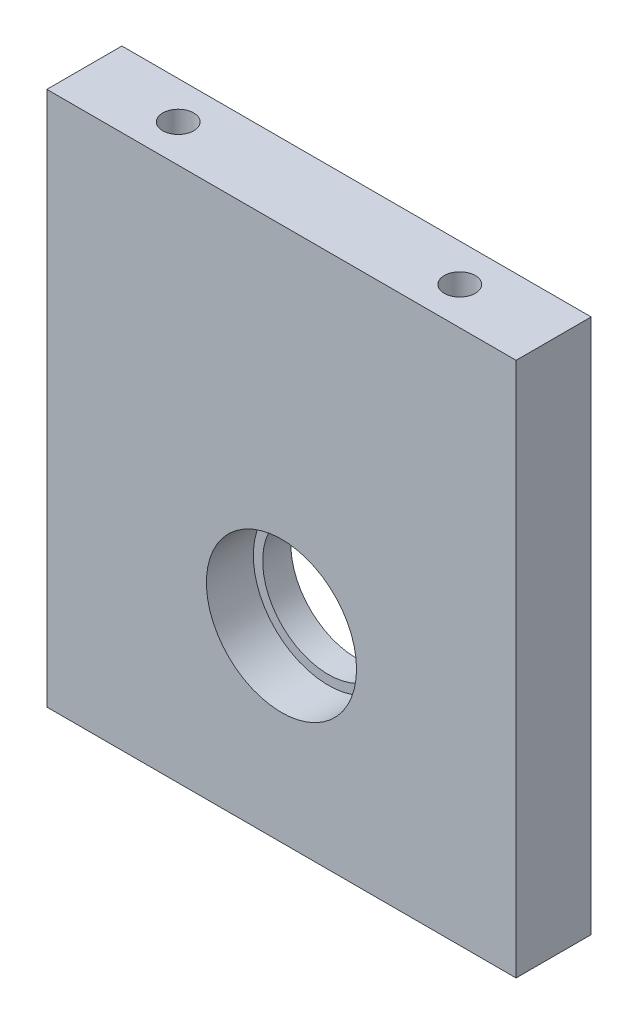
ISO-10303-21;
HEADER;
FILE_DESCRIPTION(('STEP AP214'),'2;1');
FILE_NAME('part.step','',(''),(''),'','','');
FILE_SCHEMA(('AUTOMOTIVE_DESIGN { 1 0 10303 214 1 1 1 1 }'));
ENDSEC;
DATA;
#1=APPLICATION_CONTEXT('core data for automotive mechanical design processes');
#2=APPLICATION_PROTOCOL_DEFINITION('international standard','automotive_design',2000,#1);
#3=PRODUCT_CONTEXT('',#1,'mechanical');
#4=PRODUCT('Part','Part','',(#3));
#5=PRODUCT_RELATED_PRODUCT_CATEGORY('part','',(#4));
#6=PRODUCT_DEFINITION_FORMATION('','',#4);
#7=PRODUCT_DEFINITION_CONTEXT('part definition',#1,'design');
#8=PRODUCT_DEFINITION('design','',#6,#7);
#9=PRODUCT_DEFINITION_SHAPE('','',#8);
#10=(LENGTH_UNIT() NAMED_UNIT(*) SI_UNIT(.MILLI.,.METRE.));
#11=(NAMED_UNIT(*) PLANE_ANGLE_UNIT() SI_UNIT($,.RADIAN.));
#12=(NAMED_UNIT(*) SI_UNIT($,.STERADIAN.) SOLID_ANGLE_UNIT());
#13=UNCERTAINTY_MEASURE_WITH_UNIT(LENGTH_MEASURE(1.E-05),#10,'distance_accuracy_value','');
#14=(GEOMETRIC_REPRESENTATION_CONTEXT(3) GLOBAL_UNCERTAINTY_ASSIGNED_CONTEXT((#13)) GLOBAL_UNIT_ASSIGNED_CONTEXT((#10,
#11,#12)) REPRESENTATION_CONTEXT('',''));
#15=CARTESIAN_POINT('',(0.,0.,0.));
#16=DIRECTION('',(0.,0.,1.));
#17=DIRECTION('',(1.,0.,0.));
#18=AXIS2_PLACEMENT_3D('',#15,#16,#17);
#19=CARTESIAN_POINT('',(25.,20.,8.));
#20=DIRECTION('',(0.,0.,-1.));
#21=DIRECTION('',(-1.,0.,0.));
#22=AXIS2_PLACEMENT_3D('',#19,#20,#21);
#23=CYLINDRICAL_SURFACE('',#22,7.);
#24=CARTESIAN_POINT('',(25.,20.,0.));
#25=DIRECTION('',(0.,0.,1.));
#26=DIRECTION('',(1.,0.,0.));
#27=AXIS2_PLACEMENT_3D('',#24,#25,#26);
#28=CIRCLE('',#27,7.);
#29=CARTESIAN_POINT('',(32.,20.,0.));
#30=VERTEX_POINT('',#29);
#31=EDGE_CURVE('E101',#30,#30,#28,.T.);
#32=ORIENTED_EDGE('',*,*,#31,.F.);
#33=EDGE_LOOP('',(#32));
#34=FACE_BOUND('',#33,.T.);
#35=CARTESIAN_POINT('',(25.,20.,3.));
#36=DIRECTION('',(0.,0.,1.));
#37=DIRECTION('',(1.,0.,0.));
#38=AXIS2_PLACEMENT_3D('',#35,#36,#37);
#39=CIRCLE('',#38,7.);
#40=CARTESIAN_POINT('',(32.,20.,3.));
#41=VERTEX_POINT('',#40);
#42=EDGE_CURVE('E36',#41,#41,#39,.T.);
#43=ORIENTED_EDGE('',*,*,#42,.T.);
#44=EDGE_LOOP('',(#43));
#45=FACE_BOUND('',#44,.T.);
#46=ADVANCED_FACE('F32',(#34,#45),#23,.F.);
#47=CARTESIAN_POINT('',(0.,0.,8.));
#48=DIRECTION('',(0.,0.,-1.));
#49=DIRECTION('',(-1.,0.,0.));
#50=AXIS2_PLACEMENT_3D('',#47,#48,#49);
#51=PLANE('',#50);
#52=CARTESIAN_POINT('',(25.,20.,8.));
#53=DIRECTION('',(0.,0.,1.));
#54=DIRECTION('',(1.,0.,0.));
#55=AXIS2_PLACEMENT_3D('',#52,#53,#54);
#56=CIRCLE('',#55,8.);
#57=CARTESIAN_POINT('',(33.,20.,8.));
#58=VERTEX_POINT('',#57);
#59=EDGE_CURVE('E115',#58,#58,#56,.T.);
#60=ORIENTED_EDGE('',*,*,#59,.F.);
#61=EDGE_LOOP('',(#60));
#62=FACE_BOUND('',#61,.T.);
#63=DIRECTION('',(0.,-1.,0.));
#64=VECTOR('',#63,1.);
#65=CARTESIAN_POINT('',(0.,0.,8.));
#66=LINE('',#65,#64);
#67=CARTESIAN_POINT('',(0.,57.,8.));
#68=VERTEX_POINT('',#67);
#69=CARTESIAN_POINT('',(0.,0.,8.));
#70=VERTEX_POINT('',#69);
#71=EDGE_CURVE('E85',#68,#70,#66,.T.);
#72=ORIENTED_EDGE('',*,*,#71,.T.);
#73=DIRECTION('',(1.,0.,0.));
#74=VECTOR('',#73,1.);
#75=CARTESIAN_POINT('',(0.,0.,8.));
#76=LINE('',#75,#74);
#77=CARTESIAN_POINT('',(50.,0.,8.));
#78=VERTEX_POINT('',#77);
#79=EDGE_CURVE('E80',#70,#78,#76,.T.);
#80=ORIENTED_EDGE('',*,*,#79,.T.);
#81=DIRECTION('',(0.,1.,0.));
#82=VECTOR('',#81,1.);
#83=CARTESIAN_POINT('',(50.,0.,8.));
#84=LINE('',#83,#82);
#85=CARTESIAN_POINT('',(50.,57.,8.));
#86=VERTEX_POINT('',#85);
#87=EDGE_CURVE('E83',#78,#86,#84,.T.);
#88=ORIENTED_EDGE('',*,*,#87,.T.);
#89=DIRECTION('',(-1.,0.,0.));
#90=VECTOR('',#89,1.);
#91=CARTESIAN_POINT('',(0.,57.,8.));
#92=LINE('',#91,#90);
#93=EDGE_CURVE('E50',#86,#68,#92,.T.);
#94=ORIENTED_EDGE('',*,*,#93,.T.);
#95=EDGE_LOOP('',(#72,#80,#88,#94));
#96=FACE_BOUND('',#95,.T.);
#97=ADVANCED_FACE('F81',(#62,#96),#51,.F.);
#98=CARTESIAN_POINT('',(0.,0.,0.));
#99=DIRECTION('',(0.,0.,-1.));
#100=DIRECTION('',(-1.,0.,0.));
#101=AXIS2_PLACEMENT_3D('',#98,#99,#100);
#102=PLANE('',#101);
#103=DIRECTION('',(0.,-1.,0.));
#104=VECTOR('',#103,1.);
#105=CARTESIAN_POINT('',(0.,0.,0.));
#106=LINE('',#105,#104);
#107=CARTESIAN_POINT('',(0.,57.,0.));
#108=VERTEX_POINT('',#107);
#109=CARTESIAN_POINT('',(0.,0.,0.));
#110=VERTEX_POINT('',#109);
#111=EDGE_CURVE('E98',#108,#110,#106,.T.);
#112=ORIENTED_EDGE('',*,*,#111,.F.);
#113=DIRECTION('',(-1.,0.,0.));
#114=VECTOR('',#113,1.);
#115=CARTESIAN_POINT('',(0.,57.,0.));
#116=LINE('',#115,#114);
#117=CARTESIAN_POINT('',(50.,57.,0.));
#118=VERTEX_POINT('',#117);
#119=EDGE_CURVE('E73',#118,#108,#116,.T.);
#120=ORIENTED_EDGE('',*,*,#119,.F.);
#121=DIRECTION('',(0.,1.,0.));
#122=VECTOR('',#121,1.);
#123=CARTESIAN_POINT('',(50.,0.,0.));
#124=LINE('',#123,#122);
#125=CARTESIAN_POINT('',(50.,0.,0.));
#126=VERTEX_POINT('',#125);
#127=EDGE_CURVE('E67',#126,#118,#124,.T.);
#128=ORIENTED_EDGE('',*,*,#127,.F.);
#129=DIRECTION('',(1.,0.,0.));
#130=VECTOR('',#129,1.);
#131=CARTESIAN_POINT('',(0.,0.,0.));
#132=LINE('',#131,#130);
#133=EDGE_CURVE('E89',#110,#126,#132,.T.);
#134=ORIENTED_EDGE('',*,*,#133,.F.);
#135=EDGE_LOOP('',(#112,#120,#128,#134));
#136=FACE_BOUND('',#135,.T.);
#137=ORIENTED_EDGE('',*,*,#31,.T.);
#138=EDGE_LOOP('',(#137));
#139=FACE_BOUND('',#138,.T.);
#140=ADVANCED_FACE('F109',(#136,#139),#102,.T.);
#141=CARTESIAN_POINT('',(0.,0.,8.));
#142=DIRECTION('',(1.,0.,0.));
#143=DIRECTION('',(0.,0.,-1.));
#144=AXIS2_PLACEMENT_3D('',#141,#142,#143);
#145=PLANE('',#144);
#146=ORIENTED_EDGE('',*,*,#111,.T.);
#147=DIRECTION('',(0.,0.,-1.));
#148=VECTOR('',#147,1.);
#149=CARTESIAN_POINT('',(0.,0.,8.));
#150=LINE('',#149,#148);
#151=EDGE_CURVE('E11',#70,#110,#150,.T.);
#152=ORIENTED_EDGE('',*,*,#151,.F.);
#153=ORIENTED_EDGE('',*,*,#71,.F.);
#154=DIRECTION('',(0.,0.,-1.));
#155=VECTOR('',#154,1.);
#156=CARTESIAN_POINT('',(0.,57.,8.));
#157=LINE('',#156,#155);
#158=EDGE_CURVE('E94',#68,#108,#157,.T.);
#159=ORIENTED_EDGE('',*,*,#158,.T.);
#160=EDGE_LOOP('',(#146,#152,#153,#159));
#161=FACE_BOUND('',#160,.T.);
#162=ADVANCED_FACE('F34',(#161),#145,.F.);
#163=CARTESIAN_POINT('',(0.,0.,8.));
#164=DIRECTION('',(0.,1.,0.));
#165=DIRECTION('',(0.,0.,1.));
#166=AXIS2_PLACEMENT_3D('',#163,#164,#165);
#167=PLANE('',#166);
#168=ORIENTED_EDGE('',*,*,#133,.T.);
#169=DIRECTION('',(0.,0.,-1.));
#170=VECTOR('',#169,1.);
#171=CARTESIAN_POINT('',(50.,0.,8.));
#172=LINE('',#171,#170);
#173=EDGE_CURVE('E42',#78,#126,#172,.T.);
#174=ORIENTED_EDGE('',*,*,#173,.F.);
#175=ORIENTED_EDGE('',*,*,#79,.F.);
#176=ORIENTED_EDGE('',*,*,#151,.T.);
#177=EDGE_LOOP('',(#168,#174,#175,#176));
#178=FACE_BOUND('',#177,.T.);
#179=ADVANCED_FACE('F88',(#178),#167,.F.);
#180=CARTESIAN_POINT('',(50.,0.,8.));
#181=DIRECTION('',(-1.,0.,0.));
#182=DIRECTION('',(0.,0.,1.));
#183=AXIS2_PLACEMENT_3D('',#180,#181,#182);
#184=PLANE('',#183);
#185=ORIENTED_EDGE('',*,*,#127,.T.);
#186=DIRECTION('',(0.,0.,-1.));
#187=VECTOR('',#186,1.);
#188=CARTESIAN_POINT('',(50.,57.,8.));
#189=LINE('',#188,#187);
#190=EDGE_CURVE('E90',#86,#118,#189,.T.);
#191=ORIENTED_EDGE('',*,*,#190,.F.);
#192=ORIENTED_EDGE('',*,*,#87,.F.);
#193=ORIENTED_EDGE('',*,*,#173,.T.);
#194=EDGE_LOOP('',(#185,#191,#192,#193));
#195=FACE_BOUND('',#194,.T.);
#196=ADVANCED_FACE('F92',(#195),#184,.F.);
#197=CARTESIAN_POINT('',(0.,57.,8.));
#198=DIRECTION('',(0.,-1.,0.));
#199=DIRECTION('',(0.,0.,-1.));
#200=AXIS2_PLACEMENT_3D('',#197,#198,#199);
#201=PLANE('',#200);
#202=CARTESIAN_POINT('',(40.,57.,4.));
#203=DIRECTION('',(0.,1.,0.));
#204=DIRECTION('',(0.,0.,-1.));
#205=AXIS2_PLACEMENT_3D('',#202,#203,#204);
#206=CIRCLE('',#205,1.65);
#207=CARTESIAN_POINT('',(40.,57.,2.35));
#208=VERTEX_POINT('',#207);
#209=EDGE_CURVE('E128',#208,#208,#206,.T.);
#210=ORIENTED_EDGE('',*,*,#209,.F.);
#211=EDGE_LOOP('',(#210));
#212=FACE_BOUND('',#211,.T.);
#213=CARTESIAN_POINT('',(10.,57.,4.));
#214=DIRECTION('',(0.,1.,0.));
#215=DIRECTION('',(0.,0.,1.));
#216=AXIS2_PLACEMENT_3D('',#213,#214,#215);
#217=CIRCLE('',#216,1.65);
#218=CARTESIAN_POINT('',(10.,57.,5.65));
#219=VERTEX_POINT('',#218);
#220=EDGE_CURVE('E122',#219,#219,#217,.T.);
#221=ORIENTED_EDGE('',*,*,#220,.F.);
#222=EDGE_LOOP('',(#221));
#223=FACE_BOUND('',#222,.T.);
#224=ORIENTED_EDGE('',*,*,#119,.T.);
#225=ORIENTED_EDGE('',*,*,#158,.F.);
#226=ORIENTED_EDGE('',*,*,#93,.F.);
#227=ORIENTED_EDGE('',*,*,#190,.T.);
#228=EDGE_LOOP('',(#224,#225,#226,#227));
#229=FACE_BOUND('',#228,.T.);
#230=ADVANCED_FACE('F106',(#212,#223,#229),#201,.F.);
#231=CARTESIAN_POINT('',(25.,20.,3.));
#232=DIRECTION('',(0.,0.,1.));
#233=DIRECTION('',(1.,0.,0.));
#234=AXIS2_PLACEMENT_3D('',#231,#232,#233);
#235=CYLINDRICAL_SURFACE('',#234,8.);
#236=CARTESIAN_POINT('',(25.,20.,3.));
#237=DIRECTION('',(0.,0.,1.));
#238=DIRECTION('',(1.,0.,0.));
#239=AXIS2_PLACEMENT_3D('',#236,#237,#238);
#240=CIRCLE('',#239,8.);
#241=CARTESIAN_POINT('',(33.,20.,3.));
#242=VERTEX_POINT('',#241);
#243=EDGE_CURVE('E118',#242,#242,#240,.T.);
#244=ORIENTED_EDGE('',*,*,#243,.F.);
#245=EDGE_LOOP('',(#244));
#246=FACE_BOUND('',#245,.T.);
#247=ORIENTED_EDGE('',*,*,#59,.T.);
#248=EDGE_LOOP('',(#247));
#249=FACE_BOUND('',#248,.T.);
#250=ADVANCED_FACE('F145',(#246,#249),#235,.F.);
#251=CARTESIAN_POINT('',(25.,20.,3.));
#252=DIRECTION('',(0.,0.,1.));
#253=DIRECTION('',(1.,0.,0.));
#254=AXIS2_PLACEMENT_3D('',#251,#252,#253);
#255=PLANE('',#254);
#256=ORIENTED_EDGE('',*,*,#42,.F.);
#257=EDGE_LOOP('',(#256));
#258=FACE_BOUND('',#257,.T.);
#259=ORIENTED_EDGE('',*,*,#243,.T.);
#260=EDGE_LOOP('',(#259));
#261=FACE_BOUND('',#260,.T.);
#262=ADVANCED_FACE('F151',(#258,#261),#255,.T.);
#263=CARTESIAN_POINT('',(10.,47.,4.));
#264=DIRECTION('',(0.,1.,0.));
#265=DIRECTION('',(0.,0.,1.));
#266=AXIS2_PLACEMENT_3D('',#263,#264,#265);
#267=CYLINDRICAL_SURFACE('',#266,1.65);
#268=CARTESIAN_POINT('',(10.,47.,4.));
#269=DIRECTION('',(0.,1.,0.));
#270=DIRECTION('',(0.,0.,1.));
#271=AXIS2_PLACEMENT_3D('',#268,#269,#270);
#272=CIRCLE('',#271,1.65);
#273=CARTESIAN_POINT('',(10.,47.,5.65));
#274=VERTEX_POINT('',#273);
#275=EDGE_CURVE('E119',#274,#274,#272,.T.);
#276=ORIENTED_EDGE('',*,*,#275,.F.);
#277=EDGE_LOOP('',(#276));
#278=FACE_BOUND('',#277,.T.);
#279=ORIENTED_EDGE('',*,*,#220,.T.);
#280=EDGE_LOOP('',(#279));
#281=FACE_BOUND('',#280,.T.);
#282=ADVANCED_FACE('F149',(#278,#281),#267,.F.);
#283=CARTESIAN_POINT('',(10.,47.,4.));
#284=DIRECTION('',(0.,1.,0.));
#285=DIRECTION('',(0.,0.,1.));
#286=AXIS2_PLACEMENT_3D('',#283,#284,#285);
#287=PLANE('',#286);
#288=ORIENTED_EDGE('',*,*,#275,.T.);
#289=EDGE_LOOP('',(#288));
#290=FACE_BOUND('',#289,.T.);
#291=ADVANCED_FACE('F139',(#290),#287,.T.);
#292=CARTESIAN_POINT('',(40.,47.,4.));
#293=DIRECTION('',(0.,1.,0.));
#294=DIRECTION('',(0.,0.,1.));
#295=AXIS2_PLACEMENT_3D('',#292,#293,#294);
#296=CYLINDRICAL_SURFACE('',#295,1.65);
#297=CARTESIAN_POINT('',(40.,47.,4.));
#298=DIRECTION('',(0.,1.,0.));
#299=DIRECTION('',(0.,0.,-1.));
#300=AXIS2_PLACEMENT_3D('',#297,#298,#299);
#301=CIRCLE('',#300,1.65);
#302=CARTESIAN_POINT('',(40.,47.,2.35));
#303=VERTEX_POINT('',#302);
#304=EDGE_CURVE('E125',#303,#303,#301,.T.);
#305=ORIENTED_EDGE('',*,*,#304,.F.);
#306=EDGE_LOOP('',(#305));
#307=FACE_BOUND('',#306,.T.);
#308=ORIENTED_EDGE('',*,*,#209,.T.);
#309=EDGE_LOOP('',(#308));
#310=FACE_BOUND('',#309,.T.);
#311=ADVANCED_FACE('F136',(#307,#310),#296,.F.);
#312=CARTESIAN_POINT('',(40.,47.,4.));
#313=DIRECTION('',(0.,-1.,0.));
#314=DIRECTION('',(0.,0.,-1.));
#315=AXIS2_PLACEMENT_3D('',#312,#313,#314);
#316=PLANE('',#315);
#317=ORIENTED_EDGE('',*,*,#304,.T.);
#318=EDGE_LOOP('',(#317));
#319=FACE_BOUND('',#318,.T.);
#320=ADVANCED_FACE('F134',(#319),#316,.F.);
#321=CLOSED_SHELL('',(#46,#97,#140,#162,#179,#196,#230,#250,#262,#282,#291,#311,#320));
#322=MANIFOLD_SOLID_BREP('B2',#321);
#323=ADVANCED_BREP_SHAPE_REPRESENTATION('',(#18,#322),#14);
#324=SHAPE_DEFINITION_REPRESENTATION(#9,#323);
ENDSEC;
END-ISO-10303-21;
